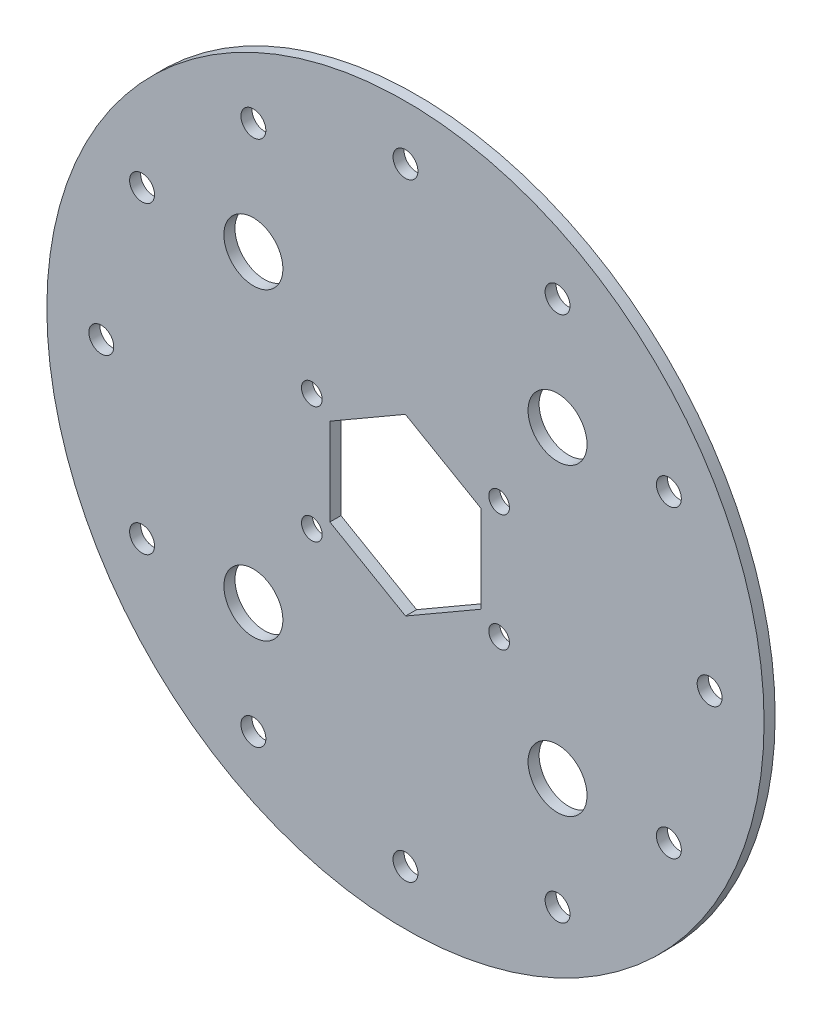
ISO-10303-21;
HEADER;
FILE_DESCRIPTION(('STEP AP214'),'2;1');
FILE_NAME('part.step','',(''),(''),'','','');
FILE_SCHEMA(('AUTOMOTIVE_DESIGN { 1 0 10303 214 1 1 1 1 }'));
ENDSEC;
DATA;
#1=APPLICATION_CONTEXT('core data for automotive mechanical design processes');
#2=APPLICATION_PROTOCOL_DEFINITION('international standard','automotive_design',2000,#1);
#3=PRODUCT_CONTEXT('',#1,'mechanical');
#4=PRODUCT('Part','Part','',(#3));
#5=PRODUCT_RELATED_PRODUCT_CATEGORY('part','',(#4));
#6=PRODUCT_DEFINITION_FORMATION('','',#4);
#7=PRODUCT_DEFINITION_CONTEXT('part definition',#1,'design');
#8=PRODUCT_DEFINITION('design','',#6,#7);
#9=PRODUCT_DEFINITION_SHAPE('','',#8);
#10=(LENGTH_UNIT() NAMED_UNIT(*) SI_UNIT(.MILLI.,.METRE.));
#11=(NAMED_UNIT(*) PLANE_ANGLE_UNIT() SI_UNIT($,.RADIAN.));
#12=(NAMED_UNIT(*) SI_UNIT($,.STERADIAN.) SOLID_ANGLE_UNIT());
#13=UNCERTAINTY_MEASURE_WITH_UNIT(LENGTH_MEASURE(1.E-05),#10,'distance_accuracy_value','');
#14=(GEOMETRIC_REPRESENTATION_CONTEXT(3) GLOBAL_UNCERTAINTY_ASSIGNED_CONTEXT((#13)) GLOBAL_UNIT_ASSIGNED_CONTEXT((#10,
#11,#12)) REPRESENTATION_CONTEXT('',''));
#15=CARTESIAN_POINT('',(0.,0.,0.));
#16=DIRECTION('',(0.,0.,1.));
#17=DIRECTION('',(1.,0.,0.));
#18=AXIS2_PLACEMENT_3D('',#15,#16,#17);
#19=CARTESIAN_POINT('',(36.2359621311499,-23.1833120974274,3.));
#20=DIRECTION('',(0.,0.,1.));
#21=DIRECTION('',(1.,0.,0.));
#22=AXIS2_PLACEMENT_3D('',#19,#20,#21);
#23=PLANE('',#22);
#24=CARTESIAN_POINT('',(118.73596213115,-23.1833120974274,3.));
#25=DIRECTION('',(0.,0.,-1.));
#26=DIRECTION('',(-1.,0.,0.));
#27=AXIS2_PLACEMENT_3D('',#24,#25,#26);
#28=CIRCLE('',#27,3.3782);
#29=CARTESIAN_POINT('',(115.35776213115,-23.1833120974274,3.));
#30=VERTEX_POINT('',#29);
#31=EDGE_CURVE('E191',#30,#30,#28,.T.);
#32=ORIENTED_EDGE('',*,*,#31,.T.);
#33=EDGE_LOOP('',(#32));
#34=FACE_BOUND('',#33,.T.);
#35=CARTESIAN_POINT('',(107.683057943366,-64.4333120974273,3.));
#36=DIRECTION('',(0.,0.,-1.));
#37=DIRECTION('',(-1.,0.,0.));
#38=AXIS2_PLACEMENT_3D('',#35,#36,#37);
#39=CIRCLE('',#38,3.3782);
#40=CARTESIAN_POINT('',(104.304857943366,-64.4333120974273,3.));
#41=VERTEX_POINT('',#40);
#42=EDGE_CURVE('E195',#41,#41,#39,.T.);
#43=ORIENTED_EDGE('',*,*,#42,.T.);
#44=EDGE_LOOP('',(#43));
#45=FACE_BOUND('',#44,.T.);
#46=CARTESIAN_POINT('',(-46.2640378688501,-23.1833120974274,3.));
#47=DIRECTION('',(0.,0.,-1.));
#48=DIRECTION('',(-1.,0.,0.));
#49=AXIS2_PLACEMENT_3D('',#46,#47,#48);
#50=CIRCLE('',#49,3.3782);
#51=CARTESIAN_POINT('',(-49.6422378688501,-23.1833120974274,3.));
#52=VERTEX_POINT('',#51);
#53=EDGE_CURVE('E199',#52,#52,#50,.T.);
#54=ORIENTED_EDGE('',*,*,#53,.T.);
#55=EDGE_LOOP('',(#54));
#56=FACE_BOUND('',#55,.T.);
#57=CARTESIAN_POINT('',(-35.2111336810662,-64.4333120974274,3.));
#58=DIRECTION('',(0.,0.,-1.));
#59=DIRECTION('',(-1.,0.,0.));
#60=AXIS2_PLACEMENT_3D('',#57,#58,#59);
#61=CIRCLE('',#60,3.3782);
#62=CARTESIAN_POINT('',(-38.5893336810662,-64.4333120974274,3.));
#63=VERTEX_POINT('',#62);
#64=EDGE_CURVE('E203',#63,#63,#61,.T.);
#65=ORIENTED_EDGE('',*,*,#64,.T.);
#66=EDGE_LOOP('',(#65));
#67=FACE_BOUND('',#66,.T.);
#68=CARTESIAN_POINT('',(77.48596213115,-94.6304079096435,3.));
#69=DIRECTION('',(0.,0.,-1.));
#70=DIRECTION('',(-1.,0.,0.));
#71=AXIS2_PLACEMENT_3D('',#68,#69,#70);
#72=CIRCLE('',#71,3.3782);
#73=CARTESIAN_POINT('',(74.10776213115,-94.6304079096435,3.));
#74=VERTEX_POINT('',#73);
#75=EDGE_CURVE('E207',#74,#74,#72,.T.);
#76=ORIENTED_EDGE('',*,*,#75,.T.);
#77=EDGE_LOOP('',(#76));
#78=FACE_BOUND('',#77,.T.);
#79=CARTESIAN_POINT('',(36.23596213115,-105.683312097427,3.));
#80=DIRECTION('',(0.,0.,-1.));
#81=DIRECTION('',(-1.,0.,0.));
#82=AXIS2_PLACEMENT_3D('',#79,#80,#81);
#83=CIRCLE('',#82,3.3782);
#84=CARTESIAN_POINT('',(32.85776213115,-105.683312097427,3.));
#85=VERTEX_POINT('',#84);
#86=EDGE_CURVE('E211',#85,#85,#83,.T.);
#87=ORIENTED_EDGE('',*,*,#86,.T.);
#88=EDGE_LOOP('',(#87));
#89=FACE_BOUND('',#88,.T.);
#90=CARTESIAN_POINT('',(-5.01403786885,-94.6304079096436,3.));
#91=DIRECTION('',(0.,0.,-1.));
#92=DIRECTION('',(-1.,0.,0.));
#93=AXIS2_PLACEMENT_3D('',#90,#91,#92);
#94=CIRCLE('',#93,3.3782);
#95=CARTESIAN_POINT('',(-8.39223786885,-94.6304079096436,3.));
#96=VERTEX_POINT('',#95);
#97=EDGE_CURVE('E215',#96,#96,#94,.T.);
#98=ORIENTED_EDGE('',*,*,#97,.T.);
#99=EDGE_LOOP('',(#98));
#100=FACE_BOUND('',#99,.T.);
#101=CARTESIAN_POINT('',(-35.2111336810663,18.0666879025726,3.));
#102=DIRECTION('',(0.,0.,-1.));
#103=DIRECTION('',(-1.,0.,0.));
#104=AXIS2_PLACEMENT_3D('',#101,#102,#103);
#105=CIRCLE('',#104,3.3782);
#106=CARTESIAN_POINT('',(-38.5893336810663,18.0666879025726,3.));
#107=VERTEX_POINT('',#106);
#108=EDGE_CURVE('E219',#107,#107,#105,.T.);
#109=ORIENTED_EDGE('',*,*,#108,.T.);
#110=EDGE_LOOP('',(#109));
#111=FACE_BOUND('',#110,.T.);
#112=CARTESIAN_POINT('',(-5.01403786885006,48.2637837147888,3.));
#113=DIRECTION('',(0.,0.,-1.));
#114=DIRECTION('',(-1.,0.,0.));
#115=AXIS2_PLACEMENT_3D('',#112,#113,#114);
#116=CIRCLE('',#115,3.3782);
#117=CARTESIAN_POINT('',(-8.39223786885006,48.2637837147888,3.));
#118=VERTEX_POINT('',#117);
#119=EDGE_CURVE('E223',#118,#118,#116,.T.);
#120=ORIENTED_EDGE('',*,*,#119,.T.);
#121=EDGE_LOOP('',(#120));
#122=FACE_BOUND('',#121,.T.);
#123=CARTESIAN_POINT('',(36.2359621311499,59.3166879025726,3.));
#124=DIRECTION('',(0.,0.,-1.));
#125=DIRECTION('',(-1.,0.,0.));
#126=AXIS2_PLACEMENT_3D('',#123,#124,#125);
#127=CIRCLE('',#126,3.3782);
#128=CARTESIAN_POINT('',(32.8577621311499,59.3166879025726,3.));
#129=VERTEX_POINT('',#128);
#130=EDGE_CURVE('E227',#129,#129,#127,.T.);
#131=ORIENTED_EDGE('',*,*,#130,.T.);
#132=EDGE_LOOP('',(#131));
#133=FACE_BOUND('',#132,.T.);
#134=CARTESIAN_POINT('',(77.4859621311499,48.2637837147888,3.));
#135=DIRECTION('',(0.,0.,-1.));
#136=DIRECTION('',(-1.,0.,0.));
#137=AXIS2_PLACEMENT_3D('',#134,#135,#136);
#138=CIRCLE('',#137,3.3782);
#139=CARTESIAN_POINT('',(74.1077621311499,48.2637837147888,3.));
#140=VERTEX_POINT('',#139);
#141=EDGE_CURVE('E231',#140,#140,#138,.T.);
#142=ORIENTED_EDGE('',*,*,#141,.T.);
#143=EDGE_LOOP('',(#142));
#144=FACE_BOUND('',#143,.T.);
#145=CARTESIAN_POINT('',(-5.01403786885,18.0666879025727,3.));
#146=DIRECTION('',(0.,0.,1.));
#147=DIRECTION('',(-1.,0.,0.));
#148=AXIS2_PLACEMENT_3D('',#145,#146,#147);
#149=CIRCLE('',#148,8.);
#150=CARTESIAN_POINT('',(-13.01403786885,18.0666879025727,3.));
#151=VERTEX_POINT('',#150);
#152=EDGE_CURVE('E235',#151,#151,#149,.T.);
#153=ORIENTED_EDGE('',*,*,#152,.F.);
#154=EDGE_LOOP('',(#153));
#155=FACE_BOUND('',#154,.T.);
#156=CARTESIAN_POINT('',(77.4859621311499,-64.4333120974274,3.));
#157=DIRECTION('',(0.,0.,1.));
#158=DIRECTION('',(-1.,0.,0.));
#159=AXIS2_PLACEMENT_3D('',#156,#157,#158);
#160=CIRCLE('',#159,8.);
#161=CARTESIAN_POINT('',(69.4859621311499,-64.4333120974274,3.));
#162=VERTEX_POINT('',#161);
#163=EDGE_CURVE('E238',#162,#162,#160,.T.);
#164=ORIENTED_EDGE('',*,*,#163,.F.);
#165=EDGE_LOOP('',(#164));
#166=FACE_BOUND('',#165,.T.);
#167=DIRECTION('',(0.866278336984721,-0.499561650720895,0.));
#168=VECTOR('',#167,1.);
#169=CARTESIAN_POINT('',(15.7359621311499,-35.032829738441,3.));
#170=LINE('',#169,#168);
#171=CARTESIAN_POINT('',(15.7359621311499,-35.032829738441,3.));
#172=VERTEX_POINT('',#171);
#173=CARTESIAN_POINT('',(36.2479454308596,-46.8615916955152,3.));
#174=VERTEX_POINT('',#173);
#175=EDGE_CURVE('E95',#172,#174,#170,.T.);
#176=ORIENTED_EDGE('',*,*,#175,.F.);
#177=DIRECTION('',(0.000506088211576677,-0.999999871937353,0.));
#178=VECTOR('',#177,1.);
#179=CARTESIAN_POINT('',(15.7239788314403,-11.3545501403532,3.));
#180=LINE('',#179,#178);
#181=CARTESIAN_POINT('',(15.7239788314403,-11.3545501403532,3.));
#182=VERTEX_POINT('',#181);
#183=EDGE_CURVE('E87',#182,#172,#180,.T.);
#184=ORIENTED_EDGE('',*,*,#183,.F.);
#185=DIRECTION('',(-0.865772248773145,-0.500438221216458,0.));
#186=VECTOR('',#185,1.);
#187=CARTESIAN_POINT('',(36.2239788314403,0.494967500660406,3.));
#188=LINE('',#187,#186);
#189=CARTESIAN_POINT('',(36.2239788314403,0.494967500660407,3.));
#190=VERTEX_POINT('',#189);
#191=EDGE_CURVE('E118',#190,#182,#188,.T.);
#192=ORIENTED_EDGE('',*,*,#191,.F.);
#193=DIRECTION('',(-0.866278336984721,0.499561650720895,0.));
#194=VECTOR('',#193,1.);
#195=CARTESIAN_POINT('',(56.7359621311499,-11.3337944564138,3.));
#196=LINE('',#195,#194);
#197=CARTESIAN_POINT('',(56.7359621311499,-11.3337944564138,3.));
#198=VERTEX_POINT('',#197);
#199=EDGE_CURVE('E116',#198,#190,#196,.T.);
#200=ORIENTED_EDGE('',*,*,#199,.F.);
#201=DIRECTION('',(-0.000506088211577116,0.999999871937353,0.));
#202=VECTOR('',#201,1.);
#203=CARTESIAN_POINT('',(56.7479454308596,-35.0120740545016,3.));
#204=LINE('',#203,#202);
#205=CARTESIAN_POINT('',(56.7479454308596,-35.0120740545016,3.));
#206=VERTEX_POINT('',#205);
#207=EDGE_CURVE('E111',#206,#198,#204,.T.);
#208=ORIENTED_EDGE('',*,*,#207,.F.);
#209=DIRECTION('',(0.865772248773145,0.500438221216458,0.));
#210=VECTOR('',#209,1.);
#211=CARTESIAN_POINT('',(36.2479454308596,-46.8615916955152,3.));
#212=LINE('',#211,#210);
#213=EDGE_CURVE('E109',#174,#206,#212,.T.);
#214=ORIENTED_EDGE('',*,*,#213,.F.);
#215=EDGE_LOOP('',(#176,#184,#192,#200,#208,#214));
#216=FACE_BOUND('',#215,.T.);
#217=CARTESIAN_POINT('',(10.8359621311499,-7.3083120974274,3.));
#218=DIRECTION('',(0.,0.,1.));
#219=DIRECTION('',(-1.,0.,0.));
#220=AXIS2_PLACEMENT_3D('',#217,#218,#219);
#221=CIRCLE('',#220,2.80670000000001);
#222=CARTESIAN_POINT('',(8.02926213114992,-7.3083120974274,3.));
#223=VERTEX_POINT('',#222);
#224=EDGE_CURVE('E141',#223,#223,#221,.T.);
#225=ORIENTED_EDGE('',*,*,#224,.F.);
#226=EDGE_LOOP('',(#225));
#227=FACE_BOUND('',#226,.T.);
#228=CARTESIAN_POINT('',(61.6359621311499,-39.0583120974274,3.));
#229=DIRECTION('',(0.,0.,1.));
#230=DIRECTION('',(-1.,0.,0.));
#231=AXIS2_PLACEMENT_3D('',#228,#229,#230);
#232=CIRCLE('',#231,2.80670000000001);
#233=CARTESIAN_POINT('',(58.8292621311499,-39.0583120974274,3.));
#234=VERTEX_POINT('',#233);
#235=EDGE_CURVE('E153',#234,#234,#232,.T.);
#236=ORIENTED_EDGE('',*,*,#235,.F.);
#237=EDGE_LOOP('',(#236));
#238=FACE_BOUND('',#237,.T.);
#239=CARTESIAN_POINT('',(36.2359621311499,-23.1833120974274,3.));
#240=DIRECTION('',(0.,0.,1.));
#241=DIRECTION('',(1.,0.,0.));
#242=AXIS2_PLACEMENT_3D('',#239,#240,#241);
#243=CIRCLE('',#242,97.28);
#244=CARTESIAN_POINT('',(133.51596213115,-23.1833120974274,3.));
#245=VERTEX_POINT('',#244);
#246=EDGE_CURVE('E11',#245,#245,#243,.T.);
#247=ORIENTED_EDGE('',*,*,#246,.T.);
#248=EDGE_LOOP('',(#247));
#249=FACE_BOUND('',#248,.T.);
#250=CARTESIAN_POINT('',(61.6359621311499,-7.30831209742737,3.));
#251=DIRECTION('',(0.,0.,1.));
#252=DIRECTION('',(1.,0.,0.));
#253=AXIS2_PLACEMENT_3D('',#250,#251,#252);
#254=CIRCLE('',#253,2.80670000000001);
#255=CARTESIAN_POINT('',(64.4426621311499,-7.30831209742737,3.));
#256=VERTEX_POINT('',#255);
#257=EDGE_CURVE('E159',#256,#256,#254,.T.);
#258=ORIENTED_EDGE('',*,*,#257,.F.);
#259=EDGE_LOOP('',(#258));
#260=FACE_BOUND('',#259,.T.);
#261=CARTESIAN_POINT('',(10.8359621311499,-39.0583120974274,3.));
#262=DIRECTION('',(0.,0.,1.));
#263=DIRECTION('',(1.,0.,0.));
#264=AXIS2_PLACEMENT_3D('',#261,#262,#263);
#265=CIRCLE('',#264,2.80670000000001);
#266=CARTESIAN_POINT('',(13.64266213115,-39.0583120974274,3.));
#267=VERTEX_POINT('',#266);
#268=EDGE_CURVE('E147',#267,#267,#265,.T.);
#269=ORIENTED_EDGE('',*,*,#268,.F.);
#270=EDGE_LOOP('',(#269));
#271=FACE_BOUND('',#270,.T.);
#272=CARTESIAN_POINT('',(-5.01403786885,-64.4333120974274,3.));
#273=DIRECTION('',(0.,0.,1.));
#274=DIRECTION('',(1.,0.,0.));
#275=AXIS2_PLACEMENT_3D('',#272,#273,#274);
#276=CIRCLE('',#275,8.);
#277=CARTESIAN_POINT('',(2.98596213115,-64.4333120974274,3.));
#278=VERTEX_POINT('',#277);
#279=EDGE_CURVE('E121',#278,#278,#276,.T.);
#280=ORIENTED_EDGE('',*,*,#279,.F.);
#281=EDGE_LOOP('',(#280));
#282=FACE_BOUND('',#281,.T.);
#283=CARTESIAN_POINT('',(77.4859621311499,18.0666879025726,3.));
#284=DIRECTION('',(0.,0.,1.));
#285=DIRECTION('',(1.,0.,0.));
#286=AXIS2_PLACEMENT_3D('',#283,#284,#285);
#287=CIRCLE('',#286,8.);
#288=CARTESIAN_POINT('',(85.4859621311499,18.0666879025726,3.));
#289=VERTEX_POINT('',#288);
#290=EDGE_CURVE('E245',#289,#289,#287,.T.);
#291=ORIENTED_EDGE('',*,*,#290,.F.);
#292=EDGE_LOOP('',(#291));
#293=FACE_BOUND('',#292,.T.);
#294=CARTESIAN_POINT('',(107.683057943366,18.0666879025727,3.));
#295=DIRECTION('',(0.,0.,-1.));
#296=DIRECTION('',(-1.,0.,0.));
#297=AXIS2_PLACEMENT_3D('',#294,#295,#296);
#298=CIRCLE('',#297,3.3782);
#299=CARTESIAN_POINT('',(104.304857943366,18.0666879025727,3.));
#300=VERTEX_POINT('',#299);
#301=EDGE_CURVE('E263',#300,#300,#298,.T.);
#302=ORIENTED_EDGE('',*,*,#301,.T.);
#303=EDGE_LOOP('',(#302));
#304=FACE_BOUND('',#303,.T.);
#305=ADVANCED_FACE('F34',(#34,#45,#56,#67,#78,#89,#100,#111,#122,#133,#144,#155,#166,#216,#227,
#238,#249,#260,#271,#282,#293,#304),#23,.T.);
#306=CARTESIAN_POINT('',(36.2359621311499,-23.1833120974274,0.));
#307=DIRECTION('',(0.,0.,1.));
#308=DIRECTION('',(1.,0.,0.));
#309=AXIS2_PLACEMENT_3D('',#306,#307,#308);
#310=PLANE('',#309);
#311=CARTESIAN_POINT('',(118.73596213115,-23.1833120974274,0.));
#312=DIRECTION('',(0.,0.,-1.));
#313=DIRECTION('',(-1.,0.,0.));
#314=AXIS2_PLACEMENT_3D('',#311,#312,#313);
#315=CIRCLE('',#314,3.37819999999998);
#316=CARTESIAN_POINT('',(115.35776213115,-23.1833120974274,0.));
#317=VERTEX_POINT('',#316);
#318=EDGE_CURVE('E514',#317,#317,#315,.T.);
#319=ORIENTED_EDGE('',*,*,#318,.F.);
#320=EDGE_LOOP('',(#319));
#321=FACE_BOUND('',#320,.T.);
#322=CARTESIAN_POINT('',(107.683057943366,-64.4333120974273,0.));
#323=DIRECTION('',(0.,0.,-1.));
#324=DIRECTION('',(-1.,0.,0.));
#325=AXIS2_PLACEMENT_3D('',#322,#323,#324);
#326=CIRCLE('',#325,3.37819999999998);
#327=CARTESIAN_POINT('',(104.304857943366,-64.4333120974273,0.));
#328=VERTEX_POINT('',#327);
#329=EDGE_CURVE('E516',#328,#328,#326,.T.);
#330=ORIENTED_EDGE('',*,*,#329,.F.);
#331=EDGE_LOOP('',(#330));
#332=FACE_BOUND('',#331,.T.);
#333=CARTESIAN_POINT('',(-46.2640378688501,-23.1833120974274,0.));
#334=DIRECTION('',(0.,0.,-1.));
#335=DIRECTION('',(-1.,0.,0.));
#336=AXIS2_PLACEMENT_3D('',#333,#334,#335);
#337=CIRCLE('',#336,3.37819999999999);
#338=CARTESIAN_POINT('',(-49.6422378688501,-23.1833120974274,0.));
#339=VERTEX_POINT('',#338);
#340=EDGE_CURVE('E522',#339,#339,#337,.T.);
#341=ORIENTED_EDGE('',*,*,#340,.F.);
#342=EDGE_LOOP('',(#341));
#343=FACE_BOUND('',#342,.T.);
#344=CARTESIAN_POINT('',(-35.2111336810662,-64.4333120974274,0.));
#345=DIRECTION('',(0.,0.,-1.));
#346=DIRECTION('',(-1.,0.,0.));
#347=AXIS2_PLACEMENT_3D('',#344,#345,#346);
#348=CIRCLE('',#347,3.37819999999999);
#349=CARTESIAN_POINT('',(-38.5893336810662,-64.4333120974274,0.));
#350=VERTEX_POINT('',#349);
#351=EDGE_CURVE('E526',#350,#350,#348,.T.);
#352=ORIENTED_EDGE('',*,*,#351,.F.);
#353=EDGE_LOOP('',(#352));
#354=FACE_BOUND('',#353,.T.);
#355=CARTESIAN_POINT('',(77.48596213115,-94.6304079096435,0.));
#356=DIRECTION('',(0.,0.,-1.));
#357=DIRECTION('',(-1.,0.,0.));
#358=AXIS2_PLACEMENT_3D('',#355,#356,#357);
#359=CIRCLE('',#358,3.37819999999998);
#360=CARTESIAN_POINT('',(74.10776213115,-94.6304079096435,0.));
#361=VERTEX_POINT('',#360);
#362=EDGE_CURVE('E530',#361,#361,#359,.T.);
#363=ORIENTED_EDGE('',*,*,#362,.F.);
#364=EDGE_LOOP('',(#363));
#365=FACE_BOUND('',#364,.T.);
#366=CARTESIAN_POINT('',(36.23596213115,-105.683312097427,0.));
#367=DIRECTION('',(0.,0.,-1.));
#368=DIRECTION('',(-1.,0.,0.));
#369=AXIS2_PLACEMENT_3D('',#366,#367,#368);
#370=CIRCLE('',#369,3.37819999999999);
#371=CARTESIAN_POINT('',(32.85776213115,-105.683312097427,0.));
#372=VERTEX_POINT('',#371);
#373=EDGE_CURVE('E534',#372,#372,#370,.T.);
#374=ORIENTED_EDGE('',*,*,#373,.F.);
#375=EDGE_LOOP('',(#374));
#376=FACE_BOUND('',#375,.T.);
#377=CARTESIAN_POINT('',(-5.01403786885,-94.6304079096436,0.));
#378=DIRECTION('',(0.,0.,-1.));
#379=DIRECTION('',(-1.,0.,0.));
#380=AXIS2_PLACEMENT_3D('',#377,#378,#379);
#381=CIRCLE('',#380,3.37819999999999);
#382=CARTESIAN_POINT('',(-8.39223786884999,-94.6304079096436,0.));
#383=VERTEX_POINT('',#382);
#384=EDGE_CURVE('E538',#383,#383,#381,.T.);
#385=ORIENTED_EDGE('',*,*,#384,.F.);
#386=EDGE_LOOP('',(#385));
#387=FACE_BOUND('',#386,.T.);
#388=CARTESIAN_POINT('',(-35.2111336810663,18.0666879025726,0.));
#389=DIRECTION('',(0.,0.,-1.));
#390=DIRECTION('',(-1.,0.,0.));
#391=AXIS2_PLACEMENT_3D('',#388,#389,#390);
#392=CIRCLE('',#391,3.37819999999999);
#393=CARTESIAN_POINT('',(-38.5893336810663,18.0666879025726,0.));
#394=VERTEX_POINT('',#393);
#395=EDGE_CURVE('E542',#394,#394,#392,.T.);
#396=ORIENTED_EDGE('',*,*,#395,.F.);
#397=EDGE_LOOP('',(#396));
#398=FACE_BOUND('',#397,.T.);
#399=CARTESIAN_POINT('',(-5.01403786885006,48.2637837147888,0.));
#400=DIRECTION('',(0.,0.,-1.));
#401=DIRECTION('',(-1.,0.,0.));
#402=AXIS2_PLACEMENT_3D('',#399,#400,#401);
#403=CIRCLE('',#402,3.37819999999999);
#404=CARTESIAN_POINT('',(-8.39223786885005,48.2637837147888,0.));
#405=VERTEX_POINT('',#404);
#406=EDGE_CURVE('E546',#405,#405,#403,.T.);
#407=ORIENTED_EDGE('',*,*,#406,.F.);
#408=EDGE_LOOP('',(#407));
#409=FACE_BOUND('',#408,.T.);
#410=CARTESIAN_POINT('',(36.2359621311499,59.3166879025726,0.));
#411=DIRECTION('',(0.,0.,-1.));
#412=DIRECTION('',(-1.,0.,0.));
#413=AXIS2_PLACEMENT_3D('',#410,#411,#412);
#414=CIRCLE('',#413,3.37819999999999);
#415=CARTESIAN_POINT('',(32.8577621311499,59.3166879025726,0.));
#416=VERTEX_POINT('',#415);
#417=EDGE_CURVE('E550',#416,#416,#414,.T.);
#418=ORIENTED_EDGE('',*,*,#417,.F.);
#419=EDGE_LOOP('',(#418));
#420=FACE_BOUND('',#419,.T.);
#421=CARTESIAN_POINT('',(77.4859621311499,48.2637837147888,0.));
#422=DIRECTION('',(0.,0.,-1.));
#423=DIRECTION('',(-1.,0.,0.));
#424=AXIS2_PLACEMENT_3D('',#421,#422,#423);
#425=CIRCLE('',#424,3.37819999999998);
#426=CARTESIAN_POINT('',(74.1077621311499,48.2637837147888,0.));
#427=VERTEX_POINT('',#426);
#428=EDGE_CURVE('E554',#427,#427,#425,.T.);
#429=ORIENTED_EDGE('',*,*,#428,.F.);
#430=EDGE_LOOP('',(#429));
#431=FACE_BOUND('',#430,.T.);
#432=CARTESIAN_POINT('',(10.8359621311499,-7.3083120974274,0.));
#433=DIRECTION('',(0.,0.,1.));
#434=DIRECTION('',(-1.,0.,0.));
#435=AXIS2_PLACEMENT_3D('',#432,#433,#434);
#436=CIRCLE('',#435,2.80670000000001);
#437=CARTESIAN_POINT('',(8.02926213114992,-7.3083120974274,0.));
#438=VERTEX_POINT('',#437);
#439=EDGE_CURVE('E103',#438,#438,#436,.T.);
#440=ORIENTED_EDGE('',*,*,#439,.T.);
#441=EDGE_LOOP('',(#440));
#442=FACE_BOUND('',#441,.T.);
#443=CARTESIAN_POINT('',(10.8359621311499,-39.0583120974274,0.));
#444=DIRECTION('',(0.,0.,1.));
#445=DIRECTION('',(1.,0.,0.));
#446=AXIS2_PLACEMENT_3D('',#443,#444,#445);
#447=CIRCLE('',#446,2.80670000000001);
#448=CARTESIAN_POINT('',(13.64266213115,-39.0583120974274,0.));
#449=VERTEX_POINT('',#448);
#450=EDGE_CURVE('E144',#449,#449,#447,.T.);
#451=ORIENTED_EDGE('',*,*,#450,.T.);
#452=EDGE_LOOP('',(#451));
#453=FACE_BOUND('',#452,.T.);
#454=CARTESIAN_POINT('',(61.6359621311499,-39.0583120974274,0.));
#455=DIRECTION('',(0.,0.,1.));
#456=DIRECTION('',(-1.,0.,0.));
#457=AXIS2_PLACEMENT_3D('',#454,#455,#456);
#458=CIRCLE('',#457,2.80670000000001);
#459=CARTESIAN_POINT('',(58.8292621311499,-39.0583120974274,0.));
#460=VERTEX_POINT('',#459);
#461=EDGE_CURVE('E150',#460,#460,#458,.T.);
#462=ORIENTED_EDGE('',*,*,#461,.T.);
#463=EDGE_LOOP('',(#462));
#464=FACE_BOUND('',#463,.T.);
#465=CARTESIAN_POINT('',(61.6359621311499,-7.30831209742737,0.));
#466=DIRECTION('',(0.,0.,1.));
#467=DIRECTION('',(1.,0.,0.));
#468=AXIS2_PLACEMENT_3D('',#465,#466,#467);
#469=CIRCLE('',#468,2.80670000000001);
#470=CARTESIAN_POINT('',(64.4426621311499,-7.30831209742737,0.));
#471=VERTEX_POINT('',#470);
#472=EDGE_CURVE('E156',#471,#471,#469,.T.);
#473=ORIENTED_EDGE('',*,*,#472,.T.);
#474=EDGE_LOOP('',(#473));
#475=FACE_BOUND('',#474,.T.);
#476=CARTESIAN_POINT('',(36.2359621311499,-23.1833120974274,0.));
#477=DIRECTION('',(0.,0.,1.));
#478=DIRECTION('',(1.,0.,0.));
#479=AXIS2_PLACEMENT_3D('',#476,#477,#478);
#480=CIRCLE('',#479,97.28);
#481=CARTESIAN_POINT('',(133.51596213115,-23.1833120974274,0.));
#482=VERTEX_POINT('',#481);
#483=EDGE_CURVE('E38',#482,#482,#480,.T.);
#484=ORIENTED_EDGE('',*,*,#483,.F.);
#485=EDGE_LOOP('',(#484));
#486=FACE_BOUND('',#485,.T.);
#487=DIRECTION('',(0.000506088211576677,-0.999999871937353,0.));
#488=VECTOR('',#487,1.);
#489=CARTESIAN_POINT('',(15.7239788314403,-11.3545501403532,0.));
#490=LINE('',#489,#488);
#491=CARTESIAN_POINT('',(15.7239788314403,-11.3545501403532,0.));
#492=VERTEX_POINT('',#491);
#493=CARTESIAN_POINT('',(15.7359621311499,-35.032829738441,0.));
#494=VERTEX_POINT('',#493);
#495=EDGE_CURVE('E57',#492,#494,#490,.T.);
#496=ORIENTED_EDGE('',*,*,#495,.T.);
#497=DIRECTION('',(0.866278336984721,-0.499561650720895,0.));
#498=VECTOR('',#497,1.);
#499=CARTESIAN_POINT('',(15.7359621311499,-35.032829738441,0.));
#500=LINE('',#499,#498);
#501=CARTESIAN_POINT('',(36.2479454308596,-46.8615916955152,0.));
#502=VERTEX_POINT('',#501);
#503=EDGE_CURVE('E102',#494,#502,#500,.T.);
#504=ORIENTED_EDGE('',*,*,#503,.T.);
#505=DIRECTION('',(0.865772248773145,0.500438221216458,0.));
#506=VECTOR('',#505,1.);
#507=CARTESIAN_POINT('',(36.2479454308596,-46.8615916955152,0.));
#508=LINE('',#507,#506);
#509=CARTESIAN_POINT('',(56.7479454308596,-35.0120740545016,0.));
#510=VERTEX_POINT('',#509);
#511=EDGE_CURVE('E123',#502,#510,#508,.T.);
#512=ORIENTED_EDGE('',*,*,#511,.T.);
#513=DIRECTION('',(-0.000506088211577116,0.999999871937353,0.));
#514=VECTOR('',#513,1.);
#515=CARTESIAN_POINT('',(56.7479454308596,-35.0120740545016,0.));
#516=LINE('',#515,#514);
#517=CARTESIAN_POINT('',(56.7359621311499,-11.3337944564138,0.));
#518=VERTEX_POINT('',#517);
#519=EDGE_CURVE('E126',#510,#518,#516,.T.);
#520=ORIENTED_EDGE('',*,*,#519,.T.);
#521=DIRECTION('',(-0.866278336984721,0.499561650720895,0.));
#522=VECTOR('',#521,1.);
#523=CARTESIAN_POINT('',(56.7359621311499,-11.3337944564138,0.));
#524=LINE('',#523,#522);
#525=CARTESIAN_POINT('',(36.2239788314403,0.494967500660406,0.));
#526=VERTEX_POINT('',#525);
#527=EDGE_CURVE('E129',#518,#526,#524,.T.);
#528=ORIENTED_EDGE('',*,*,#527,.T.);
#529=DIRECTION('',(-0.865772248773145,-0.500438221216458,0.));
#530=VECTOR('',#529,1.);
#531=CARTESIAN_POINT('',(36.2239788314403,0.494967500660406,0.));
#532=LINE('',#531,#530);
#533=EDGE_CURVE('E96',#526,#492,#532,.T.);
#534=ORIENTED_EDGE('',*,*,#533,.T.);
#535=EDGE_LOOP('',(#496,#504,#512,#520,#528,#534));
#536=FACE_BOUND('',#535,.T.);
#537=CARTESIAN_POINT('',(-5.01403786885,-64.4333120974274,0.));
#538=DIRECTION('',(0.,0.,1.));
#539=DIRECTION('',(1.,0.,0.));
#540=AXIS2_PLACEMENT_3D('',#537,#538,#539);
#541=CIRCLE('',#540,8.);
#542=CARTESIAN_POINT('',(2.98596213115,-64.4333120974274,0.));
#543=VERTEX_POINT('',#542);
#544=EDGE_CURVE('E240',#543,#543,#541,.T.);
#545=ORIENTED_EDGE('',*,*,#544,.T.);
#546=EDGE_LOOP('',(#545));
#547=FACE_BOUND('',#546,.T.);
#548=CARTESIAN_POINT('',(77.4859621311499,-64.4333120974274,0.));
#549=DIRECTION('',(0.,0.,1.));
#550=DIRECTION('',(-1.,0.,0.));
#551=AXIS2_PLACEMENT_3D('',#548,#549,#550);
#552=CIRCLE('',#551,8.);
#553=CARTESIAN_POINT('',(69.4859621311499,-64.4333120974274,0.));
#554=VERTEX_POINT('',#553);
#555=EDGE_CURVE('E241',#554,#554,#552,.T.);
#556=ORIENTED_EDGE('',*,*,#555,.T.);
#557=EDGE_LOOP('',(#556));
#558=FACE_BOUND('',#557,.T.);
#559=CARTESIAN_POINT('',(77.4859621311499,18.0666879025726,0.));
#560=DIRECTION('',(0.,0.,1.));
#561=DIRECTION('',(1.,0.,0.));
#562=AXIS2_PLACEMENT_3D('',#559,#560,#561);
#563=CIRCLE('',#562,8.);
#564=CARTESIAN_POINT('',(85.4859621311499,18.0666879025726,0.));
#565=VERTEX_POINT('',#564);
#566=EDGE_CURVE('E248',#565,#565,#563,.T.);
#567=ORIENTED_EDGE('',*,*,#566,.T.);
#568=EDGE_LOOP('',(#567));
#569=FACE_BOUND('',#568,.T.);
#570=CARTESIAN_POINT('',(-5.01403786885,18.0666879025727,0.));
#571=DIRECTION('',(0.,0.,1.));
#572=DIRECTION('',(-1.,0.,0.));
#573=AXIS2_PLACEMENT_3D('',#570,#571,#572);
#574=CIRCLE('',#573,8.);
#575=CARTESIAN_POINT('',(-13.01403786885,18.0666879025727,0.));
#576=VERTEX_POINT('',#575);
#577=EDGE_CURVE('E265',#576,#576,#574,.T.);
#578=ORIENTED_EDGE('',*,*,#577,.T.);
#579=EDGE_LOOP('',(#578));
#580=FACE_BOUND('',#579,.T.);
#581=CARTESIAN_POINT('',(107.683057943366,18.0666879025727,0.));
#582=DIRECTION('',(0.,0.,-1.));
#583=DIRECTION('',(-1.,0.,0.));
#584=AXIS2_PLACEMENT_3D('',#581,#582,#583);
#585=CIRCLE('',#584,3.37819999999998);
#586=CARTESIAN_POINT('',(104.304857943366,18.0666879025727,0.));
#587=VERTEX_POINT('',#586);
#588=EDGE_CURVE('E266',#587,#587,#585,.T.);
#589=ORIENTED_EDGE('',*,*,#588,.F.);
#590=EDGE_LOOP('',(#589));
#591=FACE_BOUND('',#590,.T.);
#592=ADVANCED_FACE('F165',(#321,#332,#343,#354,#365,#376,#387,#398,#409,#420,#431,#442,#453,
#464,#475,#486,#536,#547,#558,#569,#580,#591),#310,.F.);
#593=CARTESIAN_POINT('',(36.2359621311499,-23.1833120974274,3.));
#594=DIRECTION('',(0.,0.,-1.));
#595=DIRECTION('',(-1.,0.,0.));
#596=AXIS2_PLACEMENT_3D('',#593,#594,#595);
#597=CYLINDRICAL_SURFACE('',#596,97.28);
#598=ORIENTED_EDGE('',*,*,#246,.F.);
#599=EDGE_LOOP('',(#598));
#600=FACE_BOUND('',#599,.T.);
#601=ORIENTED_EDGE('',*,*,#483,.T.);
#602=EDGE_LOOP('',(#601));
#603=FACE_BOUND('',#602,.T.);
#604=ADVANCED_FACE('F36',(#600,#603),#597,.T.);
#605=CARTESIAN_POINT('',(61.6359621311499,-7.30831209742737,3.));
#606=DIRECTION('',(0.,0.,-1.));
#607=DIRECTION('',(-1.,0.,0.));
#608=AXIS2_PLACEMENT_3D('',#605,#606,#607);
#609=CYLINDRICAL_SURFACE('',#608,2.80670000000001);
#610=ORIENTED_EDGE('',*,*,#257,.T.);
#611=EDGE_LOOP('',(#610));
#612=FACE_BOUND('',#611,.T.);
#613=ORIENTED_EDGE('',*,*,#472,.F.);
#614=EDGE_LOOP('',(#613));
#615=FACE_BOUND('',#614,.T.);
#616=ADVANCED_FACE('F168',(#612,#615),#609,.F.);
#617=CARTESIAN_POINT('',(61.6359621311499,-39.0583120974274,3.));
#618=DIRECTION('',(0.,0.,-1.));
#619=DIRECTION('',(-1.,0.,0.));
#620=AXIS2_PLACEMENT_3D('',#617,#618,#619);
#621=CYLINDRICAL_SURFACE('',#620,2.80670000000001);
#622=ORIENTED_EDGE('',*,*,#235,.T.);
#623=EDGE_LOOP('',(#622));
#624=FACE_BOUND('',#623,.T.);
#625=ORIENTED_EDGE('',*,*,#461,.F.);
#626=EDGE_LOOP('',(#625));
#627=FACE_BOUND('',#626,.T.);
#628=ADVANCED_FACE('F170',(#624,#627),#621,.F.);
#629=CARTESIAN_POINT('',(10.8359621311499,-39.0583120974274,3.));
#630=DIRECTION('',(0.,0.,-1.));
#631=DIRECTION('',(-1.,0.,0.));
#632=AXIS2_PLACEMENT_3D('',#629,#630,#631);
#633=CYLINDRICAL_SURFACE('',#632,2.80670000000001);
#634=ORIENTED_EDGE('',*,*,#268,.T.);
#635=EDGE_LOOP('',(#634));
#636=FACE_BOUND('',#635,.T.);
#637=ORIENTED_EDGE('',*,*,#450,.F.);
#638=EDGE_LOOP('',(#637));
#639=FACE_BOUND('',#638,.T.);
#640=ADVANCED_FACE('F177',(#636,#639),#633,.F.);
#641=CARTESIAN_POINT('',(10.8359621311499,-7.3083120974274,3.));
#642=DIRECTION('',(0.,0.,-1.));
#643=DIRECTION('',(-1.,0.,0.));
#644=AXIS2_PLACEMENT_3D('',#641,#642,#643);
#645=CYLINDRICAL_SURFACE('',#644,2.80670000000001);
#646=ORIENTED_EDGE('',*,*,#224,.T.);
#647=EDGE_LOOP('',(#646));
#648=FACE_BOUND('',#647,.T.);
#649=ORIENTED_EDGE('',*,*,#439,.F.);
#650=EDGE_LOOP('',(#649));
#651=FACE_BOUND('',#650,.T.);
#652=ADVANCED_FACE('F316',(#648,#651),#645,.F.);
#653=CARTESIAN_POINT('',(15.7239788314403,-11.3545501403532,3.));
#654=DIRECTION('',(0.999999871937353,0.000506088211576677,0.));
#655=DIRECTION('',(-0.000506088211576677,0.999999871937353,0.));
#656=AXIS2_PLACEMENT_3D('',#653,#654,#655);
#657=PLANE('',#656);
#658=ORIENTED_EDGE('',*,*,#495,.F.);
#659=DIRECTION('',(0.,0.,-1.));
#660=VECTOR('',#659,1.);
#661=CARTESIAN_POINT('',(15.7239788314403,-11.3545501403532,3.));
#662=LINE('',#661,#660);
#663=EDGE_CURVE('E91',#182,#492,#662,.T.);
#664=ORIENTED_EDGE('',*,*,#663,.F.);
#665=ORIENTED_EDGE('',*,*,#183,.T.);
#666=DIRECTION('',(0.,0.,-1.));
#667=VECTOR('',#666,1.);
#668=CARTESIAN_POINT('',(15.7359621311499,-35.032829738441,3.));
#669=LINE('',#668,#667);
#670=EDGE_CURVE('E90',#172,#494,#669,.T.);
#671=ORIENTED_EDGE('',*,*,#670,.T.);
#672=EDGE_LOOP('',(#658,#664,#665,#671));
#673=FACE_BOUND('',#672,.T.);
#674=ADVANCED_FACE('F89',(#673),#657,.T.);
#675=CARTESIAN_POINT('',(15.7359621311499,-35.032829738441,3.));
#676=DIRECTION('',(0.499561650720895,0.866278336984721,0.));
#677=DIRECTION('',(-0.866278336984721,0.499561650720895,0.));
#678=AXIS2_PLACEMENT_3D('',#675,#676,#677);
#679=PLANE('',#678);
#680=ORIENTED_EDGE('',*,*,#503,.F.);
#681=ORIENTED_EDGE('',*,*,#670,.F.);
#682=ORIENTED_EDGE('',*,*,#175,.T.);
#683=DIRECTION('',(0.,0.,-1.));
#684=VECTOR('',#683,1.);
#685=CARTESIAN_POINT('',(36.2479454308596,-46.8615916955152,3.));
#686=LINE('',#685,#684);
#687=EDGE_CURVE('E104',#174,#502,#686,.T.);
#688=ORIENTED_EDGE('',*,*,#687,.T.);
#689=EDGE_LOOP('',(#680,#681,#682,#688));
#690=FACE_BOUND('',#689,.T.);
#691=ADVANCED_FACE('F99',(#690),#679,.T.);
#692=CARTESIAN_POINT('',(36.2479454308596,-46.8615916955152,3.));
#693=DIRECTION('',(-0.500438221216458,0.865772248773144,0.));
#694=DIRECTION('',(-0.865772248773145,-0.500438221216458,0.));
#695=AXIS2_PLACEMENT_3D('',#692,#693,#694);
#696=PLANE('',#695);
#697=ORIENTED_EDGE('',*,*,#511,.F.);
#698=ORIENTED_EDGE('',*,*,#687,.F.);
#699=ORIENTED_EDGE('',*,*,#213,.T.);
#700=DIRECTION('',(0.,0.,-1.));
#701=VECTOR('',#700,1.);
#702=CARTESIAN_POINT('',(56.7479454308596,-35.0120740545016,3.));
#703=LINE('',#702,#701);
#704=EDGE_CURVE('E138',#206,#510,#703,.T.);
#705=ORIENTED_EDGE('',*,*,#704,.T.);
#706=EDGE_LOOP('',(#697,#698,#699,#705));
#707=FACE_BOUND('',#706,.T.);
#708=ADVANCED_FACE('F307',(#707),#696,.T.);
#709=CARTESIAN_POINT('',(56.7479454308596,-35.0120740545016,3.));
#710=DIRECTION('',(-0.999999871937353,-0.000506088211577116,0.));
#711=DIRECTION('',(0.000506088211577116,-0.999999871937353,0.));
#712=AXIS2_PLACEMENT_3D('',#709,#710,#711);
#713=PLANE('',#712);
#714=ORIENTED_EDGE('',*,*,#519,.F.);
#715=ORIENTED_EDGE('',*,*,#704,.F.);
#716=ORIENTED_EDGE('',*,*,#207,.T.);
#717=DIRECTION('',(0.,0.,-1.));
#718=VECTOR('',#717,1.);
#719=CARTESIAN_POINT('',(56.7359621311499,-11.3337944564138,3.));
#720=LINE('',#719,#718);
#721=EDGE_CURVE('E136',#198,#518,#720,.T.);
#722=ORIENTED_EDGE('',*,*,#721,.T.);
#723=EDGE_LOOP('',(#714,#715,#716,#722));
#724=FACE_BOUND('',#723,.T.);
#725=ADVANCED_FACE('F303',(#724),#713,.T.);
#726=CARTESIAN_POINT('',(56.7359621311499,-11.3337944564138,3.));
#727=DIRECTION('',(-0.499561650720895,-0.866278336984721,0.));
#728=DIRECTION('',(0.866278336984721,-0.499561650720895,0.));
#729=AXIS2_PLACEMENT_3D('',#726,#727,#728);
#730=PLANE('',#729);
#731=ORIENTED_EDGE('',*,*,#527,.F.);
#732=ORIENTED_EDGE('',*,*,#721,.F.);
#733=ORIENTED_EDGE('',*,*,#199,.T.);
#734=DIRECTION('',(0.,0.,-1.));
#735=VECTOR('',#734,1.);
#736=CARTESIAN_POINT('',(36.2239788314403,0.494967500660406,3.));
#737=LINE('',#736,#735);
#738=EDGE_CURVE('E49',#190,#526,#737,.T.);
#739=ORIENTED_EDGE('',*,*,#738,.T.);
#740=EDGE_LOOP('',(#731,#732,#733,#739));
#741=FACE_BOUND('',#740,.T.);
#742=ADVANCED_FACE('F300',(#741),#730,.T.);
#743=CARTESIAN_POINT('',(36.2239788314403,0.494967500660406,3.));
#744=DIRECTION('',(0.500438221216458,-0.865772248773144,0.));
#745=DIRECTION('',(0.865772248773145,0.500438221216458,0.));
#746=AXIS2_PLACEMENT_3D('',#743,#744,#745);
#747=PLANE('',#746);
#748=ORIENTED_EDGE('',*,*,#533,.F.);
#749=ORIENTED_EDGE('',*,*,#738,.F.);
#750=ORIENTED_EDGE('',*,*,#191,.T.);
#751=ORIENTED_EDGE('',*,*,#663,.T.);
#752=EDGE_LOOP('',(#748,#749,#750,#751));
#753=FACE_BOUND('',#752,.T.);
#754=ADVANCED_FACE('F297',(#753),#747,.T.);
#755=CARTESIAN_POINT('',(-5.01403786885,-64.4333120974274,3.));
#756=DIRECTION('',(0.,0.,-1.));
#757=DIRECTION('',(-1.,0.,0.));
#758=AXIS2_PLACEMENT_3D('',#755,#756,#757);
#759=CYLINDRICAL_SURFACE('',#758,8.);
#760=ORIENTED_EDGE('',*,*,#279,.T.);
#761=EDGE_LOOP('',(#760));
#762=FACE_BOUND('',#761,.T.);
#763=ORIENTED_EDGE('',*,*,#544,.F.);
#764=EDGE_LOOP('',(#763));
#765=FACE_BOUND('',#764,.T.);
#766=ADVANCED_FACE('F254',(#762,#765),#759,.F.);
#767=CARTESIAN_POINT('',(77.4859621311499,-64.4333120974274,3.));
#768=DIRECTION('',(0.,0.,-1.));
#769=DIRECTION('',(-1.,0.,0.));
#770=AXIS2_PLACEMENT_3D('',#767,#768,#769);
#771=CYLINDRICAL_SURFACE('',#770,8.);
#772=ORIENTED_EDGE('',*,*,#163,.T.);
#773=EDGE_LOOP('',(#772));
#774=FACE_BOUND('',#773,.T.);
#775=ORIENTED_EDGE('',*,*,#555,.F.);
#776=EDGE_LOOP('',(#775));
#777=FACE_BOUND('',#776,.T.);
#778=ADVANCED_FACE('F283',(#774,#777),#771,.F.);
#779=CARTESIAN_POINT('',(77.4859621311499,18.0666879025726,3.));
#780=DIRECTION('',(0.,0.,-1.));
#781=DIRECTION('',(-1.,0.,0.));
#782=AXIS2_PLACEMENT_3D('',#779,#780,#781);
#783=CYLINDRICAL_SURFACE('',#782,8.);
#784=ORIENTED_EDGE('',*,*,#290,.T.);
#785=EDGE_LOOP('',(#784));
#786=FACE_BOUND('',#785,.T.);
#787=ORIENTED_EDGE('',*,*,#566,.F.);
#788=EDGE_LOOP('',(#787));
#789=FACE_BOUND('',#788,.T.);
#790=ADVANCED_FACE('F280',(#786,#789),#783,.F.);
#791=CARTESIAN_POINT('',(-5.01403786885,18.0666879025727,3.));
#792=DIRECTION('',(0.,0.,-1.));
#793=DIRECTION('',(-1.,0.,0.));
#794=AXIS2_PLACEMENT_3D('',#791,#792,#793);
#795=CYLINDRICAL_SURFACE('',#794,8.);
#796=ORIENTED_EDGE('',*,*,#152,.T.);
#797=EDGE_LOOP('',(#796));
#798=FACE_BOUND('',#797,.T.);
#799=ORIENTED_EDGE('',*,*,#577,.F.);
#800=EDGE_LOOP('',(#799));
#801=FACE_BOUND('',#800,.T.);
#802=ADVANCED_FACE('F282',(#798,#801),#795,.F.);
#803=CARTESIAN_POINT('',(107.683057943366,18.0666879025727,0.));
#804=DIRECTION('',(0.,0.,-1.));
#805=DIRECTION('',(-1.,0.,0.));
#806=AXIS2_PLACEMENT_3D('',#803,#804,#805);
#807=CYLINDRICAL_SURFACE('',#806,3.37819999999999);
#808=ORIENTED_EDGE('',*,*,#301,.F.);
#809=EDGE_LOOP('',(#808));
#810=FACE_BOUND('',#809,.T.);
#811=ORIENTED_EDGE('',*,*,#588,.T.);
#812=EDGE_LOOP('',(#811));
#813=FACE_BOUND('',#812,.T.);
#814=ADVANCED_FACE('F289',(#810,#813),#807,.F.);
#815=CARTESIAN_POINT('',(77.4859621311499,48.2637837147888,0.));
#816=DIRECTION('',(0.,0.,-1.));
#817=DIRECTION('',(-1.,0.,0.));
#818=AXIS2_PLACEMENT_3D('',#815,#816,#817);
#819=CYLINDRICAL_SURFACE('',#818,3.37819999999999);
#820=ORIENTED_EDGE('',*,*,#141,.F.);
#821=EDGE_LOOP('',(#820));
#822=FACE_BOUND('',#821,.T.);
#823=ORIENTED_EDGE('',*,*,#428,.T.);
#824=EDGE_LOOP('',(#823));
#825=FACE_BOUND('',#824,.T.);
#826=ADVANCED_FACE('F399',(#822,#825),#819,.F.);
#827=CARTESIAN_POINT('',(36.2359621311499,59.3166879025726,0.));
#828=DIRECTION('',(0.,0.,-1.));
#829=DIRECTION('',(-1.,0.,0.));
#830=AXIS2_PLACEMENT_3D('',#827,#828,#829);
#831=CYLINDRICAL_SURFACE('',#830,3.37819999999999);
#832=ORIENTED_EDGE('',*,*,#130,.F.);
#833=EDGE_LOOP('',(#832));
#834=FACE_BOUND('',#833,.T.);
#835=ORIENTED_EDGE('',*,*,#417,.T.);
#836=EDGE_LOOP('',(#835));
#837=FACE_BOUND('',#836,.T.);
#838=ADVANCED_FACE('F407',(#834,#837),#831,.F.);
#839=CARTESIAN_POINT('',(-5.01403786885006,48.2637837147888,0.));
#840=DIRECTION('',(0.,0.,-1.));
#841=DIRECTION('',(-1.,0.,0.));
#842=AXIS2_PLACEMENT_3D('',#839,#840,#841);
#843=CYLINDRICAL_SURFACE('',#842,3.37819999999999);
#844=ORIENTED_EDGE('',*,*,#119,.F.);
#845=EDGE_LOOP('',(#844));
#846=FACE_BOUND('',#845,.T.);
#847=ORIENTED_EDGE('',*,*,#406,.T.);
#848=EDGE_LOOP('',(#847));
#849=FACE_BOUND('',#848,.T.);
#850=ADVANCED_FACE('F417',(#846,#849),#843,.F.);
#851=CARTESIAN_POINT('',(-35.2111336810663,18.0666879025726,0.));
#852=DIRECTION('',(0.,0.,-1.));
#853=DIRECTION('',(-1.,0.,0.));
#854=AXIS2_PLACEMENT_3D('',#851,#852,#853);
#855=CYLINDRICAL_SURFACE('',#854,3.37819999999999);
#856=ORIENTED_EDGE('',*,*,#108,.F.);
#857=EDGE_LOOP('',(#856));
#858=FACE_BOUND('',#857,.T.);
#859=ORIENTED_EDGE('',*,*,#395,.T.);
#860=EDGE_LOOP('',(#859));
#861=FACE_BOUND('',#860,.T.);
#862=ADVANCED_FACE('F427',(#858,#861),#855,.F.);
#863=CARTESIAN_POINT('',(-5.01403786885,-94.6304079096436,0.));
#864=DIRECTION('',(0.,0.,-1.));
#865=DIRECTION('',(-1.,0.,0.));
#866=AXIS2_PLACEMENT_3D('',#863,#864,#865);
#867=CYLINDRICAL_SURFACE('',#866,3.37819999999999);
#868=ORIENTED_EDGE('',*,*,#97,.F.);
#869=EDGE_LOOP('',(#868));
#870=FACE_BOUND('',#869,.T.);
#871=ORIENTED_EDGE('',*,*,#384,.T.);
#872=EDGE_LOOP('',(#871));
#873=FACE_BOUND('',#872,.T.);
#874=ADVANCED_FACE('F437',(#870,#873),#867,.F.);
#875=CARTESIAN_POINT('',(36.23596213115,-105.683312097427,0.));
#876=DIRECTION('',(0.,0.,-1.));
#877=DIRECTION('',(-1.,0.,0.));
#878=AXIS2_PLACEMENT_3D('',#875,#876,#877);
#879=CYLINDRICAL_SURFACE('',#878,3.37819999999999);
#880=ORIENTED_EDGE('',*,*,#86,.F.);
#881=EDGE_LOOP('',(#880));
#882=FACE_BOUND('',#881,.T.);
#883=ORIENTED_EDGE('',*,*,#373,.T.);
#884=EDGE_LOOP('',(#883));
#885=FACE_BOUND('',#884,.T.);
#886=ADVANCED_FACE('F447',(#882,#885),#879,.F.);
#887=CARTESIAN_POINT('',(77.48596213115,-94.6304079096435,0.));
#888=DIRECTION('',(0.,0.,-1.));
#889=DIRECTION('',(-1.,0.,0.));
#890=AXIS2_PLACEMENT_3D('',#887,#888,#889);
#891=CYLINDRICAL_SURFACE('',#890,3.37819999999999);
#892=ORIENTED_EDGE('',*,*,#75,.F.);
#893=EDGE_LOOP('',(#892));
#894=FACE_BOUND('',#893,.T.);
#895=ORIENTED_EDGE('',*,*,#362,.T.);
#896=EDGE_LOOP('',(#895));
#897=FACE_BOUND('',#896,.T.);
#898=ADVANCED_FACE('F457',(#894,#897),#891,.F.);
#899=CARTESIAN_POINT('',(-35.2111336810662,-64.4333120974274,0.));
#900=DIRECTION('',(0.,0.,-1.));
#901=DIRECTION('',(-1.,0.,0.));
#902=AXIS2_PLACEMENT_3D('',#899,#900,#901);
#903=CYLINDRICAL_SURFACE('',#902,3.37819999999999);
#904=ORIENTED_EDGE('',*,*,#64,.F.);
#905=EDGE_LOOP('',(#904));
#906=FACE_BOUND('',#905,.T.);
#907=ORIENTED_EDGE('',*,*,#351,.T.);
#908=EDGE_LOOP('',(#907));
#909=FACE_BOUND('',#908,.T.);
#910=ADVANCED_FACE('F467',(#906,#909),#903,.F.);
#911=CARTESIAN_POINT('',(-46.2640378688501,-23.1833120974274,0.));
#912=DIRECTION('',(0.,0.,-1.));
#913=DIRECTION('',(-1.,0.,0.));
#914=AXIS2_PLACEMENT_3D('',#911,#912,#913);
#915=CYLINDRICAL_SURFACE('',#914,3.37819999999999);
#916=ORIENTED_EDGE('',*,*,#53,.F.);
#917=EDGE_LOOP('',(#916));
#918=FACE_BOUND('',#917,.T.);
#919=ORIENTED_EDGE('',*,*,#340,.T.);
#920=EDGE_LOOP('',(#919));
#921=FACE_BOUND('',#920,.T.);
#922=ADVANCED_FACE('F477',(#918,#921),#915,.F.);
#923=CARTESIAN_POINT('',(107.683057943366,-64.4333120974273,0.));
#924=DIRECTION('',(0.,0.,-1.));
#925=DIRECTION('',(-1.,0.,0.));
#926=AXIS2_PLACEMENT_3D('',#923,#924,#925);
#927=CYLINDRICAL_SURFACE('',#926,3.37819999999999);
#928=ORIENTED_EDGE('',*,*,#42,.F.);
#929=EDGE_LOOP('',(#928));
#930=FACE_BOUND('',#929,.T.);
#931=ORIENTED_EDGE('',*,*,#329,.T.);
#932=EDGE_LOOP('',(#931));
#933=FACE_BOUND('',#932,.T.);
#934=ADVANCED_FACE('F487',(#930,#933),#927,.F.);
#935=CARTESIAN_POINT('',(118.73596213115,-23.1833120974274,0.));
#936=DIRECTION('',(0.,0.,-1.));
#937=DIRECTION('',(-1.,0.,0.));
#938=AXIS2_PLACEMENT_3D('',#935,#936,#937);
#939=CYLINDRICAL_SURFACE('',#938,3.37819999999999);
#940=ORIENTED_EDGE('',*,*,#31,.F.);
#941=EDGE_LOOP('',(#940));
#942=FACE_BOUND('',#941,.T.);
#943=ORIENTED_EDGE('',*,*,#318,.T.);
#944=EDGE_LOOP('',(#943));
#945=FACE_BOUND('',#944,.T.);
#946=ADVANCED_FACE('F497',(#942,#945),#939,.F.);
#947=CLOSED_SHELL('',(#305,#592,#604,#616,#628,#640,#652,#674,#691,#708,#725,#742,#754,#766,
#778,#790,#802,#814,#826,#838,#850,#862,#874,#886,#898,#910,#922,#934,#946));
#948=MANIFOLD_SOLID_BREP('B2',#947);
#949=ADVANCED_BREP_SHAPE_REPRESENTATION('',(#18,#948),#14);
#950=SHAPE_DEFINITION_REPRESENTATION(#9,#949);
ENDSEC;
END-ISO-10303-21;
